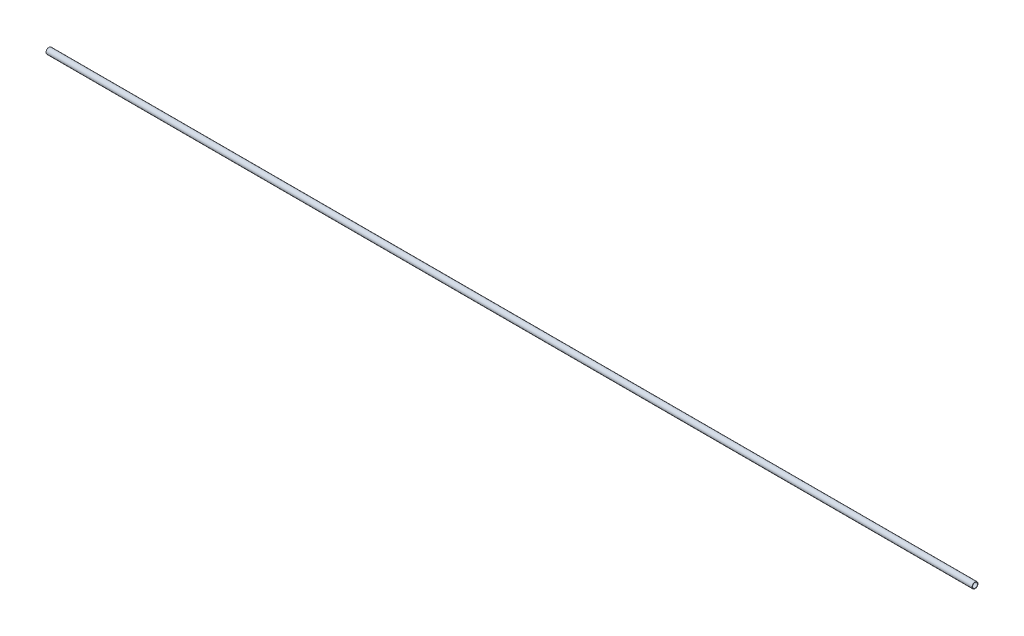
ISO-10303-21;
HEADER;
FILE_DESCRIPTION(('STEP AP214'),'2;1');
FILE_NAME('part.step','',(''),(''),'','','');
FILE_SCHEMA(('AUTOMOTIVE_DESIGN { 1 0 10303 214 1 1 1 1 }'));
ENDSEC;
DATA;
#1=APPLICATION_CONTEXT('core data for automotive mechanical design processes');
#2=APPLICATION_PROTOCOL_DEFINITION('international standard','automotive_design',2000,#1);
#3=PRODUCT_CONTEXT('',#1,'mechanical');
#4=PRODUCT('Part','Part','',(#3));
#5=PRODUCT_RELATED_PRODUCT_CATEGORY('part','',(#4));
#6=PRODUCT_DEFINITION_FORMATION('','',#4);
#7=PRODUCT_DEFINITION_CONTEXT('part definition',#1,'design');
#8=PRODUCT_DEFINITION('design','',#6,#7);
#9=PRODUCT_DEFINITION_SHAPE('','',#8);
#10=(LENGTH_UNIT() NAMED_UNIT(*) SI_UNIT(.MILLI.,.METRE.));
#11=(NAMED_UNIT(*) PLANE_ANGLE_UNIT() SI_UNIT($,.RADIAN.));
#12=(NAMED_UNIT(*) SI_UNIT($,.STERADIAN.) SOLID_ANGLE_UNIT());
#13=UNCERTAINTY_MEASURE_WITH_UNIT(LENGTH_MEASURE(1.E-05),#10,'distance_accuracy_value','');
#14=(GEOMETRIC_REPRESENTATION_CONTEXT(3) GLOBAL_UNCERTAINTY_ASSIGNED_CONTEXT((#13)) GLOBAL_UNIT_ASSIGNED_CONTEXT((#10,
#11,#12)) REPRESENTATION_CONTEXT('',''));
#15=CARTESIAN_POINT('',(0.,0.,0.));
#16=DIRECTION('',(0.,0.,1.));
#17=DIRECTION('',(1.,0.,0.));
#18=AXIS2_PLACEMENT_3D('',#15,#16,#17);
#19=CARTESIAN_POINT('',(0.,0.,0.));
#20=DIRECTION('',(1.,0.,0.));
#21=DIRECTION('',(0.,0.,-1.));
#22=AXIS2_PLACEMENT_3D('',#19,#20,#21);
#23=CYLINDRICAL_SURFACE('',#22,13.6);
#24=CARTESIAN_POINT('',(0.,0.,0.));
#25=DIRECTION('',(1.,0.,0.));
#26=DIRECTION('',(0.,0.,-1.));
#27=AXIS2_PLACEMENT_3D('',#24,#25,#26);
#28=CIRCLE('',#27,13.6);
#29=CARTESIAN_POINT('',(0.,0.,-13.6));
#30=VERTEX_POINT('',#29);
#31=EDGE_CURVE('E16',#30,#30,#28,.T.);
#32=ORIENTED_EDGE('',*,*,#31,.F.);
#33=EDGE_LOOP('',(#32));
#34=FACE_BOUND('',#33,.T.);
#35=CARTESIAN_POINT('',(5000.,0.,0.));
#36=DIRECTION('',(1.,0.,0.));
#37=DIRECTION('',(0.,0.,-1.));
#38=AXIS2_PLACEMENT_3D('',#35,#36,#37);
#39=CIRCLE('',#38,13.6);
#40=CARTESIAN_POINT('',(5000.,0.,-13.6));
#41=VERTEX_POINT('',#40);
#42=EDGE_CURVE('E25',#41,#41,#39,.F.);
#43=ORIENTED_EDGE('',*,*,#42,.F.);
#44=EDGE_LOOP('',(#43));
#45=FACE_BOUND('',#44,.T.);
#46=ADVANCED_FACE('F13',(#34,#45),#23,.F.);
#47=CARTESIAN_POINT('',(0.,-16.192002108351,-16.));
#48=DIRECTION('',(-1.,0.,0.));
#49=DIRECTION('',(0.,0.,1.));
#50=AXIS2_PLACEMENT_3D('',#47,#48,#49);
#51=PLANE('',#50);
#52=ORIENTED_EDGE('',*,*,#31,.T.);
#53=EDGE_LOOP('',(#52));
#54=FACE_BOUND('',#53,.T.);
#55=CARTESIAN_POINT('',(0.,0.,0.));
#56=DIRECTION('',(1.,0.,0.));
#57=DIRECTION('',(0.,0.,-1.));
#58=AXIS2_PLACEMENT_3D('',#55,#56,#57);
#59=CIRCLE('',#58,16.);
#60=CARTESIAN_POINT('',(0.,0.,-16.));
#61=VERTEX_POINT('',#60);
#62=EDGE_CURVE('E20',#61,#61,#59,.T.);
#63=ORIENTED_EDGE('',*,*,#62,.F.);
#64=EDGE_LOOP('',(#63));
#65=FACE_BOUND('',#64,.T.);
#66=ADVANCED_FACE('F33',(#54,#65),#51,.T.);
#67=CARTESIAN_POINT('',(5000.,-16.192002108351,16.));
#68=DIRECTION('',(1.,0.,0.));
#69=DIRECTION('',(0.,0.,-1.));
#70=AXIS2_PLACEMENT_3D('',#67,#68,#69);
#71=PLANE('',#70);
#72=ORIENTED_EDGE('',*,*,#42,.T.);
#73=EDGE_LOOP('',(#72));
#74=FACE_BOUND('',#73,.T.);
#75=CARTESIAN_POINT('',(5000.,0.,0.));
#76=DIRECTION('',(1.,0.,0.));
#77=DIRECTION('',(0.,0.,-1.));
#78=AXIS2_PLACEMENT_3D('',#75,#76,#77);
#79=CIRCLE('',#78,16.);
#80=CARTESIAN_POINT('',(5000.,0.,-16.));
#81=VERTEX_POINT('',#80);
#82=EDGE_CURVE('E8',#81,#81,#79,.F.);
#83=ORIENTED_EDGE('',*,*,#82,.F.);
#84=EDGE_LOOP('',(#83));
#85=FACE_BOUND('',#84,.T.);
#86=ADVANCED_FACE('F42',(#74,#85),#71,.T.);
#87=CARTESIAN_POINT('',(5000.,0.,0.));
#88=DIRECTION('',(1.,0.,0.));
#89=DIRECTION('',(0.,0.,-1.));
#90=AXIS2_PLACEMENT_3D('',#87,#88,#89);
#91=CYLINDRICAL_SURFACE('',#90,16.);
#92=ORIENTED_EDGE('',*,*,#62,.T.);
#93=EDGE_LOOP('',(#92));
#94=FACE_BOUND('',#93,.T.);
#95=ORIENTED_EDGE('',*,*,#82,.T.);
#96=EDGE_LOOP('',(#95));
#97=FACE_BOUND('',#96,.T.);
#98=ADVANCED_FACE('F43',(#94,#97),#91,.T.);
#99=CLOSED_SHELL('',(#46,#66,#86,#98));
#100=MANIFOLD_SOLID_BREP('B1',#99);
#101=ADVANCED_BREP_SHAPE_REPRESENTATION('',(#18,#100),#14);
#102=SHAPE_DEFINITION_REPRESENTATION(#9,#101);
ENDSEC;
END-ISO-10303-21;
